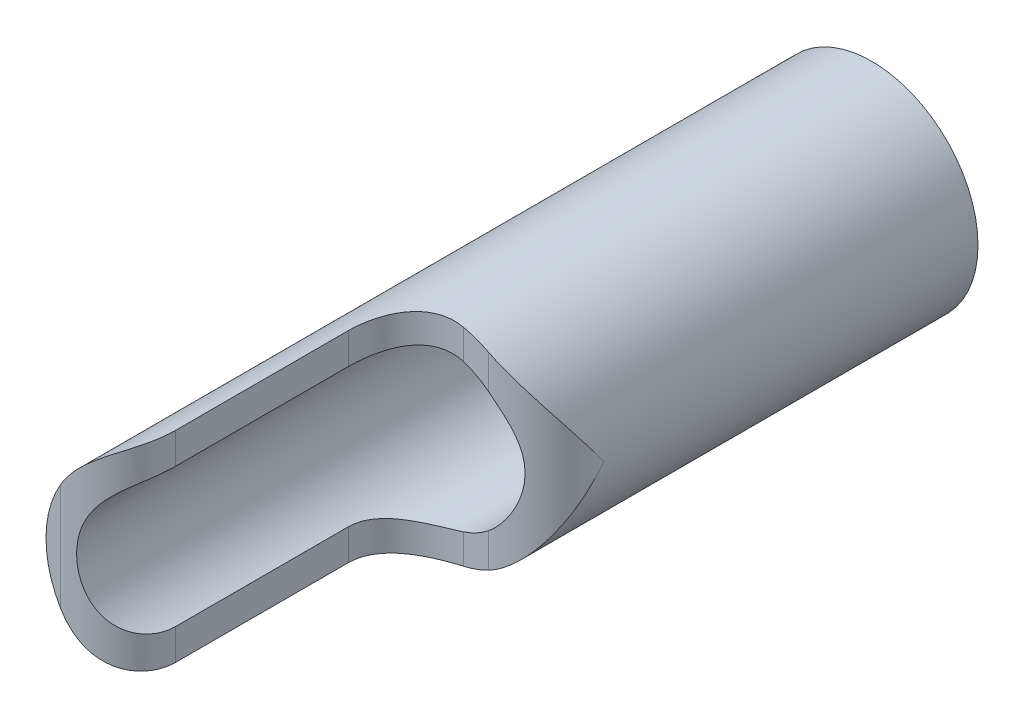
ISO-10303-21;
HEADER;
FILE_DESCRIPTION(('STEP AP214'),'2;1');
FILE_NAME('part.step','',(''),(''),'','','');
FILE_SCHEMA(('AUTOMOTIVE_DESIGN { 1 0 10303 214 1 1 1 1 }'));
ENDSEC;
DATA;
#1=APPLICATION_CONTEXT('core data for automotive mechanical design processes');
#2=APPLICATION_PROTOCOL_DEFINITION('international standard','automotive_design',2000,#1);
#3=PRODUCT_CONTEXT('',#1,'mechanical');
#4=PRODUCT('Part','Part','',(#3));
#5=PRODUCT_RELATED_PRODUCT_CATEGORY('part','',(#4));
#6=PRODUCT_DEFINITION_FORMATION('','',#4);
#7=PRODUCT_DEFINITION_CONTEXT('part definition',#1,'design');
#8=PRODUCT_DEFINITION('design','',#6,#7);
#9=PRODUCT_DEFINITION_SHAPE('','',#8);
#10=(LENGTH_UNIT() NAMED_UNIT(*) SI_UNIT(.MILLI.,.METRE.));
#11=(NAMED_UNIT(*) PLANE_ANGLE_UNIT() SI_UNIT($,.RADIAN.));
#12=(NAMED_UNIT(*) SI_UNIT($,.STERADIAN.) SOLID_ANGLE_UNIT());
#13=UNCERTAINTY_MEASURE_WITH_UNIT(LENGTH_MEASURE(1.E-05),#10,'distance_accuracy_value','');
#14=(GEOMETRIC_REPRESENTATION_CONTEXT(3) GLOBAL_UNCERTAINTY_ASSIGNED_CONTEXT((#13)) GLOBAL_UNIT_ASSIGNED_CONTEXT((#10,
#11,#12)) REPRESENTATION_CONTEXT('',''));
#15=CARTESIAN_POINT('',(0.,0.,0.));
#16=DIRECTION('',(0.,0.,1.));
#17=DIRECTION('',(1.,0.,0.));
#18=AXIS2_PLACEMENT_3D('',#15,#16,#17);
#19=CARTESIAN_POINT('',(0.,0.,5.));
#20=DIRECTION('',(0.,0.,-1.));
#21=DIRECTION('',(-1.,0.,0.));
#22=AXIS2_PLACEMENT_3D('',#19,#20,#21);
#23=CYLINDRICAL_SURFACE('',#22,0.7375);
#24=CARTESIAN_POINT('',(0.,0.,0.));
#25=DIRECTION('',(0.,0.,1.));
#26=DIRECTION('',(1.,0.,0.));
#27=AXIS2_PLACEMENT_3D('',#24,#25,#26);
#28=CIRCLE('',#27,0.7375);
#29=CARTESIAN_POINT('',(0.7375,0.,0.));
#30=VERTEX_POINT('',#29);
#31=EDGE_CURVE('E222',#30,#30,#28,.T.);
#32=ORIENTED_EDGE('',*,*,#31,.T.);
#33=EDGE_LOOP('',(#32));
#34=FACE_BOUND('',#33,.T.);
#35=CARTESIAN_POINT('',(-0.637500000000003,-0.370809924354778,5.));
#36=CARTESIAN_POINT('',(-0.628996561726813,-0.385426199470406,4.99999552634086));
#37=CARTESIAN_POINT('',(-0.619995175292166,-0.399744608109435,4.99972816782554));
#38=CARTESIAN_POINT('',(-0.601026107855252,-0.427740760986939,4.99844869487231));
#39=CARTESIAN_POINT('',(-0.591056112702408,-0.441416849065786,4.99743475677476));
#40=CARTESIAN_POINT('',(-0.55968114869128,-0.481465378055254,4.99292644532362));
#41=CARTESIAN_POINT('',(-0.536913206082381,-0.506682799659907,4.98796036317441));
#42=CARTESIAN_POINT('',(-0.496754830920334,-0.545582431144041,4.9748125953865));
#43=CARTESIAN_POINT('',(-0.479947517963044,-0.560387297253672,4.96814919606611));
#44=CARTESIAN_POINT('',(-0.446072983673307,-0.587702879434716,4.95172115484977));
#45=CARTESIAN_POINT('',(-0.429007046892141,-0.600222402425055,4.94196883209247));
#46=CARTESIAN_POINT('',(-0.395361104572798,-0.622905631118335,4.9190386950324));
#47=CARTESIAN_POINT('',(-0.378785668461834,-0.633051084120656,4.90583589306849));
#48=CARTESIAN_POINT('',(-0.347299976385541,-0.650858818291728,4.87613749991046));
#49=CARTESIAN_POINT('',(-0.33239068298219,-0.658519668870198,4.85964002050001));
#50=CARTESIAN_POINT('',(-0.306550660670169,-0.670909095325852,4.82557550062884));
#51=CARTESIAN_POINT('',(-0.295373162641385,-0.67585153879584,4.80827195810973));
#52=CARTESIAN_POINT('',(-0.275699736612727,-0.684111969318612,4.77184202102915));
#53=CARTESIAN_POINT('',(-0.267204617463129,-0.687429466547539,4.75271507889511));
#54=CARTESIAN_POINT('',(-0.252781214588114,-0.692875065510066,4.71177619395298));
#55=CARTESIAN_POINT('',(-0.247081159101871,-0.694900606732425,4.68987007429617));
#56=CARTESIAN_POINT('',(-0.239422498838726,-0.697557351347066,4.64530955723594));
#57=CARTESIAN_POINT('',(-0.237467532070182,-0.698187199044752,4.62265445396798));
#58=CARTESIAN_POINT('',(-0.2375,-0.698212002188447,4.6));
#59=B_SPLINE_CURVE_WITH_KNOTS('',3,(#35,#36,#37,#38,#39,#40,#41,#42,#43,#44,#45,#46,#47,#48,#49,
#50,#51,#52,#53,#54,#55,#56,#57,#58),.UNSPECIFIED.,.F.,.F.,(4,2,2,2,2,2,2,2,2,2,2,4),(0.,
0.0506989116596377,0.101522077419487,0.203769618881773,0.273606241995814,0.34316777961049,
0.413247742123073,0.48336798410105,0.546612545880288,0.609876160387938,0.677684358930867,
0.745558393551069),.UNSPECIFIED.);
#60=CARTESIAN_POINT('',(-0.637500000000003,-0.370809924354778,5.));
#61=VERTEX_POINT('',#60);
#62=CARTESIAN_POINT('',(-0.2375,-0.698212002188447,4.6));
#63=VERTEX_POINT('',#62);
#64=EDGE_CURVE('E226',#61,#63,#59,.T.);
#65=ORIENTED_EDGE('',*,*,#64,.F.);
#66=CARTESIAN_POINT('',(0.,0.,5.));
#67=DIRECTION('',(0.,0.,1.));
#68=DIRECTION('',(1.,0.,0.));
#69=AXIS2_PLACEMENT_3D('',#66,#67,#68);
#70=CIRCLE('',#69,0.7375);
#71=CARTESIAN_POINT('',(-0.637500000000003,0.370809924354778,5.));
#72=VERTEX_POINT('',#71);
#73=EDGE_CURVE('E115',#72,#61,#70,.T.);
#74=ORIENTED_EDGE('',*,*,#73,.F.);
#75=CARTESIAN_POINT('',(-0.2375,0.698212002188447,4.6));
#76=CARTESIAN_POINT('',(-0.237476445974745,0.698192758905024,4.62111840469348));
#77=CARTESIAN_POINT('',(-0.239171097770688,0.697642997108637,4.64223545232983));
#78=CARTESIAN_POINT('',(-0.245832216795051,0.695338261074743,4.68388051258064));
#79=CARTESIAN_POINT('',(-0.250798811900248,0.693583239732177,4.70440850214033));
#80=CARTESIAN_POINT('',(-0.263845282866923,0.688721520441658,4.74430599262739));
#81=CARTESIAN_POINT('',(-0.271928060096577,0.685613562472494,4.76367439442968));
#82=CARTESIAN_POINT('',(-0.290845960278924,0.677805082605978,4.8006525945477));
#83=CARTESIAN_POINT('',(-0.301679163276668,0.673105670873782,4.81826360772406));
#84=CARTESIAN_POINT('',(-0.325432494624503,0.661943399039492,4.85103454828523));
#85=CARTESIAN_POINT('',(-0.338324917044552,0.65550325782534,4.86622229996062));
#86=CARTESIAN_POINT('',(-0.365634552856454,0.640670367383024,4.8940568391825));
#87=CARTESIAN_POINT('',(-0.380051800180328,0.6322775746974,4.90670357016534));
#88=CARTESIAN_POINT('',(-0.409675855780943,0.613497376445984,4.92930802759275));
#89=CARTESIAN_POINT('',(-0.424883027292533,0.603109047231436,4.93926450367716));
#90=CARTESIAN_POINT('',(-0.455365243953354,0.580439845767292,4.95655952110908));
#91=CARTESIAN_POINT('',(-0.470640314866119,0.56815818256183,4.96389696406703));
#92=CARTESIAN_POINT('',(-0.505881459833931,0.537317740974416,4.97835815189728));
#93=CARTESIAN_POINT('',(-0.525630961103552,0.518061567766144,4.98451967993364));
#94=CARTESIAN_POINT('',(-0.563160941238663,0.477004865147337,4.99350766627409));
#95=CARTESIAN_POINT('',(-0.580937702613298,0.455199685854794,4.99632792176145));
#96=CARTESIAN_POINT('',(-0.604623945817655,0.422477828350383,4.99871203094801));
#97=CARTESIAN_POINT('',(-0.611574254600024,0.412352159127204,4.99921536099166));
#98=CARTESIAN_POINT('',(-0.624935418219899,0.391805060899791,4.99985816294509));
#99=CARTESIAN_POINT('',(-0.631348589098136,0.381385191641392,4.99999928407447));
#100=CARTESIAN_POINT('',(-0.637500000000003,0.370809924354778,5.));
#101=B_SPLINE_CURVE_WITH_KNOTS('',3,(#75,#76,#77,#78,#79,#80,#81,#82,#83,#84,#85,#86,#87,#88,
#89,#90,#91,#92,#93,#94,#95,#96,#97,#98,#99,#100),.UNSPECIFIED.,.F.,.F.,(4,2,2,2,2,2,2,2,2,2,2,
2,4),(0.,0.0632790392228509,0.126560551715866,0.189901126259248,0.253197606436818,
0.315704849377474,0.378213483588335,0.440751120399606,0.503314953978146,0.587642253815969,
0.672125856746996,0.708985475002355,0.745676962863285),.UNSPECIFIED.);
#102=CARTESIAN_POINT('',(-0.2375,0.698212002188447,4.6));
#103=VERTEX_POINT('',#102);
#104=EDGE_CURVE('E229',#103,#72,#101,.T.);
#105=ORIENTED_EDGE('',*,*,#104,.F.);
#106=DIRECTION('',(0.,0.,-1.));
#107=VECTOR('',#106,1.);
#108=CARTESIAN_POINT('',(-0.2375,0.698212002188447,5.));
#109=LINE('',#108,#107);
#110=CARTESIAN_POINT('',(-0.2375,0.698212002188447,3.4));
#111=VERTEX_POINT('',#110);
#112=EDGE_CURVE('E122',#111,#103,#109,.F.);
#113=ORIENTED_EDGE('',*,*,#112,.F.);
#114=CARTESIAN_POINT('',(0.162500000000003,0.719374728496908,3.));
#115=CARTESIAN_POINT('',(0.142694717190646,0.723878082893564,2.99997128296188));
#116=CARTESIAN_POINT('',(0.122693530012335,0.727507666622426,3.00146989147211));
#117=CARTESIAN_POINT('',(0.0829734689168517,0.733083365059043,3.00748037697718));
#118=CARTESIAN_POINT('',(0.0632539204231128,0.735034576254266,3.01198305743763));
#119=CARTESIAN_POINT('',(0.0246290168082387,0.737344992502883,3.02396491479157));
#120=CARTESIAN_POINT('',(0.00572426571177353,0.737703035950773,3.03144625915074));
#121=CARTESIAN_POINT('',(-0.030714129515712,0.737085257765069,3.0491740808542));
#122=CARTESIAN_POINT('',(-0.0482473809673,0.736109055585531,3.05942134640974));
#123=CARTESIAN_POINT('',(-0.0818177399852219,0.733145239757301,3.08261521311406));
#124=CARTESIAN_POINT('',(-0.0978204700499401,0.731138932619787,3.09560899690926));
#125=CARTESIAN_POINT('',(-0.127606711909665,0.726533042569313,3.12384822442694));
#126=CARTESIAN_POINT('',(-0.141388871430826,0.723933100458718,3.13909502943246));
#127=CARTESIAN_POINT('',(-0.16746129926039,0.718369820785761,3.17281005213091));
#128=CARTESIAN_POINT('',(-0.179541831661347,0.715394083044209,3.19143885782087));
#129=CARTESIAN_POINT('',(-0.200474264772106,0.709812136004042,3.23047080431263));
#130=CARTESIAN_POINT('',(-0.209327824241046,0.707205737276637,3.25087302682718));
#131=CARTESIAN_POINT('',(-0.223363477701856,0.7029017394401,3.29240864257973));
#132=CARTESIAN_POINT('',(-0.228634322091982,0.701182447524812,3.31350963552811));
#133=CARTESIAN_POINT('',(-0.235717324583807,0.698818442681402,3.35639806828374));
#134=CARTESIAN_POINT('',(-0.237520107259952,0.698176643198914,3.37818720743292));
#135=CARTESIAN_POINT('',(-0.2375,0.698212002188447,3.4));
#136=B_SPLINE_CURVE_WITH_KNOTS('',3,(#114,#115,#116,#117,#118,#119,#120,#121,#122,#123,#124,
#125,#126,#127,#128,#129,#130,#131,#132,#133,#134,#135),.UNSPECIFIED.,.F.,.F.,(4,2,2,2,2,2,2,2,
2,2,4),(0.,0.060853374938409,0.121521305645053,0.182233463123826,0.242962940192574,
0.304835625681598,0.366745848880014,0.433645295926396,0.500510306026364,0.565651865429939,
0.630969279922107),.UNSPECIFIED.);
#137=CARTESIAN_POINT('',(0.162500000000003,0.719374728496908,3.));
#138=VERTEX_POINT('',#137);
#139=EDGE_CURVE('E176',#138,#111,#136,.T.);
#140=ORIENTED_EDGE('',*,*,#139,.F.);
#141=CARTESIAN_POINT('',(0.,0.,3.));
#142=DIRECTION('',(0.,0.,1.));
#143=DIRECTION('',(1.,0.,0.));
#144=AXIS2_PLACEMENT_3D('',#141,#142,#143);
#145=CIRCLE('',#144,0.7375);
#146=CARTESIAN_POINT('',(0.337499999999997,0.655743852430202,3.));
#147=VERTEX_POINT('',#146);
#148=EDGE_CURVE('E186',#147,#138,#145,.T.);
#149=ORIENTED_EDGE('',*,*,#148,.F.);
#150=CARTESIAN_POINT('',(0.337499999999998,0.655743852430202,3.));
#151=CARTESIAN_POINT('',(0.362367076326452,0.642977540472614,2.99999272383672));
#152=CARTESIAN_POINT('',(0.386344528897247,0.628819503021606,2.99768847114949));
#153=CARTESIAN_POINT('',(0.4318997805156,0.59841380187594,2.98938276520022));
#154=CARTESIAN_POINT('',(0.453500170501194,0.582189688148315,2.9834204618511));
#155=CARTESIAN_POINT('',(0.500208105441171,0.543034480767911,2.96648838096887));
#156=CARTESIAN_POINT('',(0.524478514947686,0.519534248622704,2.95456156984866));
#157=CARTESIAN_POINT('',(0.568890740945396,0.470500454147149,2.92732345427889));
#158=CARTESIAN_POINT('',(0.58900994534086,0.444956755441205,2.91199451079332));
#159=CARTESIAN_POINT('',(0.63250275278507,0.381904328989016,2.8723198340796));
#160=CARTESIAN_POINT('',(0.653887475598739,0.34374416188204,2.84683842170703));
#161=CARTESIAN_POINT('',(0.689197556047606,0.265966918663157,2.79323247271032));
#162=CARTESIAN_POINT('',(0.703122819434776,0.226349824150168,2.76510790269595));
#163=CARTESIAN_POINT('',(0.721418667234227,0.156288857891478,2.71461674587146));
#164=CARTESIAN_POINT('',(0.727302340190862,0.126006587450632,2.69255191428825));
#165=CARTESIAN_POINT('',(0.735243028397519,0.0652682125696525,2.64806207783041));
#166=CARTESIAN_POINT('',(0.737306607340444,0.0348124966561384,2.62563775764427));
#167=CARTESIAN_POINT('',(0.737495674021141,0.00291554164716203,2.60214717803077));
#168=CARTESIAN_POINT('',(0.737499995675227,0.00145774468968771,2.60107356925657));
#169=CARTESIAN_POINT('',(0.7375,0.,2.6));
#170=B_SPLINE_CURVE_WITH_KNOTS('',3,(#150,#151,#152,#153,#154,#155,#156,#157,#158,#159,#160,
#161,#162,#163,#164,#165,#166,#167,#168,#169),.UNSPECIFIED.,.F.,.F.,(4,2,2,2,2,2,2,2,2,4),(0.,
0.0834898432603343,0.166101365561473,0.273011344254887,0.380489135239561,0.531551910981967,
0.682616595312141,0.796217947780126,0.909623928367917,0.915055334092762),.UNSPECIFIED.);
#171=CARTESIAN_POINT('',(0.7375,0.,2.6));
#172=VERTEX_POINT('',#171);
#173=EDGE_CURVE('E187',#172,#147,#170,.F.);
#174=ORIENTED_EDGE('',*,*,#173,.F.);
#175=CARTESIAN_POINT('',(0.337499999999998,-0.655743852430202,3.));
#176=CARTESIAN_POINT('',(0.362367076326452,-0.642977540472614,2.99999272383672));
#177=CARTESIAN_POINT('',(0.386344528897247,-0.628819503021606,2.99768847114949));
#178=CARTESIAN_POINT('',(0.4318997805156,-0.59841380187594,2.98938276520022));
#179=CARTESIAN_POINT('',(0.453500170501194,-0.582189688148315,2.9834204618511));
#180=CARTESIAN_POINT('',(0.500208105441171,-0.543034480767911,2.96648838096887));
#181=CARTESIAN_POINT('',(0.524478514947686,-0.519534248622704,2.95456156984866));
#182=CARTESIAN_POINT('',(0.568890740945396,-0.470500454147149,2.92732345427889));
#183=CARTESIAN_POINT('',(0.58900994534086,-0.444956755441205,2.91199451079332));
#184=CARTESIAN_POINT('',(0.63250275278507,-0.381904328989016,2.8723198340796));
#185=CARTESIAN_POINT('',(0.653887475598739,-0.34374416188204,2.84683842170703));
#186=CARTESIAN_POINT('',(0.689197556047606,-0.265966918663157,2.79323247271032));
#187=CARTESIAN_POINT('',(0.703122819434776,-0.226349824150168,2.76510790269595));
#188=CARTESIAN_POINT('',(0.721418667234227,-0.156288857891478,2.71461674587146));
#189=CARTESIAN_POINT('',(0.727302340190862,-0.126006587450632,2.69255191428825));
#190=CARTESIAN_POINT('',(0.735243028397519,-0.0652682125696525,2.64806207783041));
#191=CARTESIAN_POINT('',(0.737306607340444,-0.0348124966561384,2.62563775764427));
#192=CARTESIAN_POINT('',(0.737495674021141,-0.00291554164716203,2.60214717803077));
#193=CARTESIAN_POINT('',(0.737499995675227,-0.00145774468968771,2.60107356925657));
#194=CARTESIAN_POINT('',(0.7375,0.,2.6));
#195=B_SPLINE_CURVE_WITH_KNOTS('',3,(#175,#176,#177,#178,#179,#180,#181,#182,#183,#184,#185,
#186,#187,#188,#189,#190,#191,#192,#193,#194),.UNSPECIFIED.,.F.,.F.,(4,2,2,2,2,2,2,2,2,4),(0.,
0.0834898432603343,0.166101365561473,0.273011344254887,0.380489135239561,0.531551910981967,
0.682616595312141,0.796217947780126,0.909623928367917,0.915055334092762),.UNSPECIFIED.);
#196=CARTESIAN_POINT('',(0.337499999999997,-0.655743852430202,3.));
#197=VERTEX_POINT('',#196);
#198=EDGE_CURVE('E193',#197,#172,#195,.T.);
#199=ORIENTED_EDGE('',*,*,#198,.F.);
#200=CARTESIAN_POINT('',(0.162500000000003,-0.719374728496908,3.));
#201=VERTEX_POINT('',#200);
#202=EDGE_CURVE('E184',#201,#197,#145,.T.);
#203=ORIENTED_EDGE('',*,*,#202,.F.);
#204=CARTESIAN_POINT('',(-0.2375,-0.698212002188447,3.4));
#205=CARTESIAN_POINT('',(-0.237520924262842,-0.698175343363305,3.37798475648705));
#206=CARTESIAN_POINT('',(-0.235684114549617,-0.698829750909065,3.35599352910171));
#207=CARTESIAN_POINT('',(-0.228471601029537,-0.701236105496217,3.31273083734603));
#208=CARTESIAN_POINT('',(-0.223107393151829,-0.702984486341482,3.29145727007067));
#209=CARTESIAN_POINT('',(-0.209019448473507,-0.707296123192682,3.25016520826842));
#210=CARTESIAN_POINT('',(-0.200298015241077,-0.709858820243644,3.23014586408114));
#211=CARTESIAN_POINT('',(-0.179742635712777,-0.715340851565579,3.19180958759251));
#212=CARTESIAN_POINT('',(-0.167905908636984,-0.718260503209032,3.1734941961459));
#213=CARTESIAN_POINT('',(-0.140940143559106,-0.724042965916932,3.13840770363267));
#214=CARTESIAN_POINT('',(-0.125710865181665,-0.726900262829325,3.12171252763222));
#215=CARTESIAN_POINT('',(-0.0925936189319345,-0.73185542403546,3.09107350975676));
#216=CARTESIAN_POINT('',(-0.0747066716062983,-0.733953578782575,3.07712861653429));
#217=CARTESIAN_POINT('',(-0.0370222247880903,-0.73680872051416,3.05259682769332));
#218=CARTESIAN_POINT('',(-0.0172556586576067,-0.737584433214844,3.04196481957865));
#219=CARTESIAN_POINT('',(0.0237720856033643,-0.737401172912485,3.02416311025469));
#220=CARTESIAN_POINT('',(0.0450320487393986,-0.736443594718755,3.01699063098426));
#221=CARTESIAN_POINT('',(0.0824460121013702,-0.733048941460279,3.0077542180543));
#222=CARTESIAN_POINT('',(0.0984380865858376,-0.731078207885197,3.00483568060052));
#223=CARTESIAN_POINT('',(0.130493485122031,-0.726047503568434,3.00095347867413));
#224=CARTESIAN_POINT('',(0.146556829715901,-0.722987195501323,2.9999904202252));
#225=CARTESIAN_POINT('',(0.162500000000003,-0.719374728496908,3.));
#226=B_SPLINE_CURVE_WITH_KNOTS('',3,(#204,#205,#206,#207,#208,#209,#210,#211,#212,#213,#214,
#215,#216,#217,#218,#219,#220,#221,#222,#223,#224,#225),.UNSPECIFIED.,.F.,.F.,(4,2,2,2,2,2,2,2,
2,2,4),(0.,0.0659220925432566,0.13163040015283,0.197293701985209,0.263015816295341,
0.331025132205434,0.399008399666088,0.466020776240178,0.532979250762095,0.581957272055605,
0.630950469841611),.UNSPECIFIED.);
#227=CARTESIAN_POINT('',(-0.2375,-0.698212002188447,3.4));
#228=VERTEX_POINT('',#227);
#229=EDGE_CURVE('E170',#228,#201,#226,.T.);
#230=ORIENTED_EDGE('',*,*,#229,.F.);
#231=DIRECTION('',(0.,0.,-1.));
#232=VECTOR('',#231,1.);
#233=CARTESIAN_POINT('',(-0.2375,-0.698212002188447,5.));
#234=LINE('',#233,#232);
#235=EDGE_CURVE('E177',#63,#228,#234,.T.);
#236=ORIENTED_EDGE('',*,*,#235,.F.);
#237=EDGE_LOOP('',(#65,#74,#105,#113,#140,#149,#174,#199,#203,#230,#236));
#238=FACE_BOUND('',#237,.T.);
#239=ADVANCED_FACE('F32',(#34,#238),#23,.T.);
#240=CARTESIAN_POINT('',(0.,0.,5.));
#241=DIRECTION('',(0.,0.,-1.));
#242=DIRECTION('',(-1.,0.,0.));
#243=AXIS2_PLACEMENT_3D('',#240,#241,#242);
#244=CYLINDRICAL_SURFACE('',#243,0.5375);
#245=CARTESIAN_POINT('',(0.,0.,0.));
#246=DIRECTION('',(0.,0.,1.));
#247=DIRECTION('',(1.,0.,0.));
#248=AXIS2_PLACEMENT_3D('',#245,#246,#247);
#249=CIRCLE('',#248,0.5375);
#250=CARTESIAN_POINT('',(0.5375,0.,0.));
#251=VERTEX_POINT('',#250);
#252=EDGE_CURVE('E280',#251,#251,#249,.T.);
#253=ORIENTED_EDGE('',*,*,#252,.F.);
#254=EDGE_LOOP('',(#253));
#255=FACE_BOUND('',#254,.T.);
#256=CARTESIAN_POINT('',(0.,0.,3.));
#257=DIRECTION('',(0.,0.,1.));
#258=DIRECTION('',(1.,0.,0.));
#259=AXIS2_PLACEMENT_3D('',#256,#257,#258);
#260=CIRCLE('',#259,0.5375);
#261=CARTESIAN_POINT('',(0.162500000000003,-0.512347538297979,3.));
#262=VERTEX_POINT('',#261);
#263=CARTESIAN_POINT('',(0.337499999999997,-0.41833001326704,3.));
#264=VERTEX_POINT('',#263);
#265=EDGE_CURVE('E352',#262,#264,#260,.T.);
#266=ORIENTED_EDGE('',*,*,#265,.T.);
#267=CARTESIAN_POINT('',(0.337499999999998,-0.41833001326704,3.));
#268=CARTESIAN_POINT('',(0.359273978932191,-0.400781463859006,2.99998818593622));
#269=CARTESIAN_POINT('',(0.379552027197627,-0.381601791338084,2.99822749254655));
#270=CARTESIAN_POINT('',(0.416714090932502,-0.340606851884415,2.99252817329268));
#271=CARTESIAN_POINT('',(0.433612483293453,-0.318803409718792,2.98859905240678));
#272=CARTESIAN_POINT('',(0.463739241651148,-0.273129756092368,2.97987977859214));
#273=CARTESIAN_POINT('',(0.476983961296415,-0.249269402953364,2.97509362594326));
#274=CARTESIAN_POINT('',(0.499755860025098,-0.199734295318798,2.96582005345011));
#275=CARTESIAN_POINT('',(0.509277777395294,-0.174057032909144,2.96133306380638));
#276=CARTESIAN_POINT('',(0.525237927817365,-0.118197091304364,2.95333461240189));
#277=CARTESIAN_POINT('',(0.531176462723935,-0.0878412563834462,2.95000197667996));
#278=CARTESIAN_POINT('',(0.537734427508156,-0.0264151284636312,2.94629839093263));
#279=CARTESIAN_POINT('',(0.538364075146914,0.00465367663922553,2.94592175173898));
#280=CARTESIAN_POINT('',(0.534546515497908,0.0624437808457871,2.94810125294943));
#281=CARTESIAN_POINT('',(0.530722906585841,0.0892238798200117,2.95029735614784));
#282=CARTESIAN_POINT('',(0.519169190095633,0.141755750457248,2.95642459311644));
#283=CARTESIAN_POINT('',(0.51143182532009,0.167505515525867,2.96035894837049));
#284=CARTESIAN_POINT('',(0.491888643924289,0.218466374192933,2.96916542426225));
#285=CARTESIAN_POINT('',(0.479929971633536,0.243612823300619,2.97406921027158));
#286=CARTESIAN_POINT('',(0.452262664278041,0.29177665788276,2.98346095406692));
#287=CARTESIAN_POINT('',(0.436562517099425,0.314798701108954,2.98794982159845));
#288=CARTESIAN_POINT('',(0.407093462857348,0.351494146025094,2.99409006740046));
#289=CARTESIAN_POINT('',(0.39425455823349,0.36584056153043,2.99618979629448));
#290=CARTESIAN_POINT('',(0.367012927454278,0.393169863645469,2.999145303603));
#291=CARTESIAN_POINT('',(0.352606383911212,0.406149263177364,2.99999796899082));
#292=CARTESIAN_POINT('',(0.337499999999997,0.41833001326704,3.));
#293=B_SPLINE_CURVE_WITH_KNOTS('',3,(#267,#268,#269,#270,#271,#272,#273,#274,#275,#276,#277,
#278,#279,#280,#281,#282,#283,#284,#285,#286,#287,#288,#289,#290,#291,#292),.UNSPECIFIED.,.F.,
.F.,(4,2,2,2,2,2,2,2,2,2,2,2,4),(0.,0.0835619277588196,0.166760450462991,0.249580304716672,
0.332516794887423,0.425290147006809,0.517884901841691,0.598927338254845,0.680120603923694,
0.764620479195682,0.848930453472342,0.906890378789058,0.964994743133208),.UNSPECIFIED.);
#294=CARTESIAN_POINT('',(0.337499999999997,0.41833001326704,3.));
#295=VERTEX_POINT('',#294);
#296=EDGE_CURVE('E11',#264,#295,#293,.T.);
#297=ORIENTED_EDGE('',*,*,#296,.T.);
#298=CARTESIAN_POINT('',(0.162500000000003,0.512347538297979,3.));
#299=VERTEX_POINT('',#298);
#300=EDGE_CURVE('E46',#295,#299,#260,.T.);
#301=ORIENTED_EDGE('',*,*,#300,.T.);
#302=CARTESIAN_POINT('',(0.162500000000003,0.512347538297979,3.));
#303=CARTESIAN_POINT('',(0.144568558814499,0.51806756802947,2.99996926510194));
#304=CARTESIAN_POINT('',(0.126317021643056,0.52278801723525,3.00120478102256));
#305=CARTESIAN_POINT('',(0.0898338005099877,0.530257040165967,3.00623486891216));
#306=CARTESIAN_POINT('',(0.07160228675133,0.53301273998798,3.01002009494789));
#307=CARTESIAN_POINT('',(0.0356605548427395,0.536622566480448,3.02018088334493));
#308=CARTESIAN_POINT('',(0.0179509156265123,0.537474654379374,3.02655921429579));
#309=CARTESIAN_POINT('',(-0.0163932494217824,0.537524217053534,3.04174067179047));
#310=CARTESIAN_POINT('',(-0.0330274446190128,0.53672118544974,3.0505445397064));
#311=CARTESIAN_POINT('',(-0.0650728277804065,0.533793373550097,3.07049576640217));
#312=CARTESIAN_POINT('',(-0.0804592164002238,0.531646936493477,3.08167950136238));
#313=CARTESIAN_POINT('',(-0.109410498226309,0.526452535184965,3.10602222363929));
#314=CARTESIAN_POINT('',(-0.122974230066009,0.523404000054863,3.1191824591475));
#315=CARTESIAN_POINT('',(-0.149716103528864,0.516436309936419,3.14905412992172));
#316=CARTESIAN_POINT('',(-0.162611286111321,0.512455425529546,3.16600492106767));
#317=CARTESIAN_POINT('',(-0.185573490564858,0.504595391723477,3.20176567566827));
#318=CARTESIAN_POINT('',(-0.195637940729963,0.500716337718291,3.2205773088546));
#319=CARTESIAN_POINT('',(-0.213326853522544,0.493453312008776,3.2611489197754));
#320=CARTESIAN_POINT('',(-0.220713834296899,0.490127710775754,3.2830241340701));
#321=CARTESIAN_POINT('',(-0.231611121581875,0.485078482135044,3.32785703488205));
#322=CARTESIAN_POINT('',(-0.235133007107078,0.483350072348272,3.35081127220444));
#323=CARTESIAN_POINT('',(-0.237217553748553,0.482319742806852,3.382588915572));
#324=CARTESIAN_POINT('',(-0.23750326147758,0.482176776612737,3.39129654110246));
#325=CARTESIAN_POINT('',(-0.237500000000001,0.482182538049816,3.40000000000001));
#326=B_SPLINE_CURVE_WITH_KNOTS('',3,(#302,#303,#304,#305,#306,#307,#308,#309,#310,#311,#312,
#313,#314,#315,#316,#317,#318,#319,#320,#321,#322,#323,#324,#325),.UNSPECIFIED.,.F.,.F.,(4,2,2,
2,2,2,2,2,2,2,2,4),(0.,0.0563973229589648,0.112589039049587,0.168840907768985,0.225109989139691,
0.282310400804569,0.339547088523822,0.404277124553033,0.469065778925896,0.538678598716729,
0.60808229895708,0.634199184760811),.UNSPECIFIED.);
#327=CARTESIAN_POINT('',(-0.2375,0.482182538049648,3.4));
#328=VERTEX_POINT('',#327);
#329=EDGE_CURVE('E130',#299,#328,#326,.T.);
#330=ORIENTED_EDGE('',*,*,#329,.T.);
#331=DIRECTION('',(0.,0.,-1.));
#332=VECTOR('',#331,1.);
#333=CARTESIAN_POINT('',(-0.2375,0.482182538049648,5.));
#334=LINE('',#333,#332);
#335=CARTESIAN_POINT('',(-0.2375,0.482182538049648,4.6));
#336=VERTEX_POINT('',#335);
#337=EDGE_CURVE('E114',#328,#336,#334,.F.);
#338=ORIENTED_EDGE('',*,*,#337,.T.);
#339=CARTESIAN_POINT('',(-0.2375,0.482182538049648,4.6));
#340=CARTESIAN_POINT('',(-0.237474502565265,0.482160518416086,4.61981845541681));
#341=CARTESIAN_POINT('',(-0.238971503838128,0.48145688967973,4.63963888938524));
#342=CARTESIAN_POINT('',(-0.244836924685399,0.478519369738206,4.67874982931369));
#343=CARTESIAN_POINT('',(-0.249207630180777,0.476284260239425,4.69803990065361));
#344=CARTESIAN_POINT('',(-0.260653824766357,0.470112215805685,4.73554736479044));
#345=CARTESIAN_POINT('',(-0.267732835658847,0.466173064107863,4.75376332509755));
#346=CARTESIAN_POINT('',(-0.284192869233313,0.456325183101595,4.78852831305541));
#347=CARTESIAN_POINT('',(-0.293571400533957,0.450418582929467,4.80507911760524));
#348=CARTESIAN_POINT('',(-0.313811808799026,0.436548582944943,4.83570198958134));
#349=CARTESIAN_POINT('',(-0.324635901108775,0.42863403854028,4.84982114090624));
#350=CARTESIAN_POINT('',(-0.347192388733855,0.410574965612116,4.87571086621463));
#351=CARTESIAN_POINT('',(-0.35892483051216,0.400430322968,4.8874813199496));
#352=CARTESIAN_POINT('',(-0.382322515849352,0.378143654204515,4.90842818786207));
#353=CARTESIAN_POINT('',(-0.393986194909382,0.36603332237463,4.91764032854072));
#354=CARTESIAN_POINT('',(-0.416720971372668,0.339926230956028,4.93384425796916));
#355=CARTESIAN_POINT('',(-0.427791848433349,0.325928776637719,4.94083522581465));
#356=CARTESIAN_POINT('',(-0.44973444325246,0.295018267933522,4.95343843481415));
#357=CARTESIAN_POINT('',(-0.460498751524018,0.277956223182779,4.9588701911051));
#358=CARTESIAN_POINT('',(-0.480190226531103,0.242360265045422,4.96792836515531));
#359=CARTESIAN_POINT('',(-0.489116233806885,0.223825432886867,4.97155364556118));
#360=CARTESIAN_POINT('',(-0.506254109575426,0.182224528851193,4.97798606372427));
#361=CARTESIAN_POINT('',(-0.51404649456547,0.158944311468002,4.98052753851752));
#362=CARTESIAN_POINT('',(-0.526394690451035,0.111439012797698,4.98431372745813));
#363=CARTESIAN_POINT('',(-0.530948619274334,0.087213390688122,4.9855576877332));
#364=CARTESIAN_POINT('',(-0.53710600884197,0.0348377194170899,4.98721269096503));
#365=CARTESIAN_POINT('',(-0.538195229121005,0.00662130275283062,4.98747941253694));
#366=CARTESIAN_POINT('',(-0.535943648555131,-0.0496407450115895,4.98689440584334));
#367=CARTESIAN_POINT('',(-0.532599504448871,-0.077686231182111,4.98604183350754));
#368=CARTESIAN_POINT('',(-0.521378701129078,-0.133869959420029,4.982820601312));
#369=CARTESIAN_POINT('',(-0.513337523672442,-0.161972591393322,4.9803965409021));
#370=CARTESIAN_POINT('',(-0.492938166281744,-0.216226095066274,4.97312004589544));
#371=CARTESIAN_POINT('',(-0.480586038746226,-0.242379641056159,4.96827101175262));
#372=CARTESIAN_POINT('',(-0.455889131528271,-0.285529842347719,4.95658556841334));
#373=CARTESIAN_POINT('',(-0.444311934052941,-0.303182765509372,4.95054721538985));
#374=CARTESIAN_POINT('',(-0.419784744708696,-0.336318550340993,4.93586262111748));
#375=CARTESIAN_POINT('',(-0.406836222575996,-0.351803694831354,4.92721915395185));
#376=CARTESIAN_POINT('',(-0.380354113873838,-0.380286733700325,4.90684845394152));
#377=CARTESIAN_POINT('',(-0.366817078923394,-0.39326654278544,4.89510015058002));
#378=CARTESIAN_POINT('',(-0.340387614239969,-0.416354678061274,4.86846749454507));
#379=CARTESIAN_POINT('',(-0.327494917951968,-0.426464199893789,4.85358445218647));
#380=CARTESIAN_POINT('',(-0.304886521266079,-0.442858157484188,4.82290971073371));
#381=CARTESIAN_POINT('',(-0.29497575817564,-0.449450391846099,4.80742404297142));
#382=CARTESIAN_POINT('',(-0.27716840065447,-0.460646340553219,4.77466713257222));
#383=CARTESIAN_POINT('',(-0.269272827606124,-0.46524904733927,4.75739499068301));
#384=CARTESIAN_POINT('',(-0.256024362217294,-0.472667723718663,4.72179263863569));
#385=CARTESIAN_POINT('',(-0.250642274714138,-0.475504343122237,4.703477499946));
#386=CARTESIAN_POINT('',(-0.242543628513689,-0.479688131149903,4.66613005196928));
#387=CARTESIAN_POINT('',(-0.239822724914932,-0.481037728085602,4.64709896455397));
#388=CARTESIAN_POINT('',(-0.23782487235872,-0.482021049360516,4.61865585349384));
#389=CARTESIAN_POINT('',(-0.237496734292427,-0.482180097053766,4.60932523889731));
#390=CARTESIAN_POINT('',(-0.237499999999998,-0.482182538049965,4.60000000000001));
#391=B_SPLINE_CURVE_WITH_KNOTS('',3,(#339,#340,#341,#342,#343,#344,#345,#346,#347,#348,#349,
#350,#351,#352,#353,#354,#355,#356,#357,#358,#359,#360,#361,#362,#363,#364,#365,#366,#367,#368,
#369,#370,#371,#372,#373,#374,#375,#376,#377,#378,#379,#380,#381,#382,#383,#384,#385,#386,#387,
#388,#389,#390),.UNSPECIFIED.,.F.,.F.,(4,2,2,2,2,2,2,2,2,2,2,2,2,2,2,2,2,2,2,2,2,2,2,2,2,4),(0.,
0.0593906589428064,0.118828618115732,0.178344132860075,0.237795449140072,0.295919682004909,
0.354046889948493,0.41131606888875,0.468606388901435,0.531047896843118,0.593528668310498,
0.667283566352241,0.741081293089627,0.825418214219325,0.909818771178539,0.997369599221955,
1.08479800067493,1.15040602338019,1.21594442805415,1.28193955971272,1.34790716008614,
1.4062170612872,1.46455645795146,1.52220024428177,1.57974975799976,1.60773230725826),.UNSPECIFIED.);
#392=CARTESIAN_POINT('',(-0.2375,-0.482182538049648,4.6));
#393=VERTEX_POINT('',#392);
#394=EDGE_CURVE('E109',#336,#393,#391,.T.);
#395=ORIENTED_EDGE('',*,*,#394,.T.);
#396=DIRECTION('',(0.,0.,-1.));
#397=VECTOR('',#396,1.);
#398=CARTESIAN_POINT('',(-0.2375,-0.482182538049648,5.));
#399=LINE('',#398,#397);
#400=CARTESIAN_POINT('',(-0.2375,-0.482182538049648,3.4));
#401=VERTEX_POINT('',#400);
#402=EDGE_CURVE('E131',#393,#401,#399,.T.);
#403=ORIENTED_EDGE('',*,*,#402,.T.);
#404=CARTESIAN_POINT('',(-0.2375,-0.482182538049648,3.4));
#405=CARTESIAN_POINT('',(-0.237522184592161,-0.482130696947714,3.37842514938005));
#406=CARTESIAN_POINT('',(-0.235756487214807,-0.483042241283851,3.3568930417494));
#407=CARTESIAN_POINT('',(-0.228856232064285,-0.486369906724637,3.31460862515029));
#408=CARTESIAN_POINT('',(-0.223739920633072,-0.488777875189477,3.29385273265943));
#409=CARTESIAN_POINT('',(-0.21035379663748,-0.49467911816104,3.25360673121387));
#410=CARTESIAN_POINT('',(-0.202089821857564,-0.498170381336727,3.23411435673288));
#411=CARTESIAN_POINT('',(-0.182635420061864,-0.505628149530661,3.19671077728902));
#412=CARTESIAN_POINT('',(-0.171439752943323,-0.509595498554975,3.17880248116702));
#413=CARTESIAN_POINT('',(-0.145498296878982,-0.517622104304384,3.14379037700464));
#414=CARTESIAN_POINT('',(-0.130563367815128,-0.521669375603888,3.12682328622441));
#415=CARTESIAN_POINT('',(-0.0979281042410683,-0.52876703461606,3.09555469930496));
#416=CARTESIAN_POINT('',(-0.0802300163065816,-0.531818226012452,3.08125105819385));
#417=CARTESIAN_POINT('',(-0.0429127115969403,-0.53610549296344,3.05605114602103));
#418=CARTESIAN_POINT('',(-0.0233443873533338,-0.537380062771857,3.04508677218521));
#419=CARTESIAN_POINT('',(0.0173671889060338,-0.537603321449656,3.02659043042335));
#420=CARTESIAN_POINT('',(0.0385086329352676,-0.536554641716372,3.01905459086819));
#421=CARTESIAN_POINT('',(0.076951074149024,-0.53223666714377,3.00886091223379));
#422=CARTESIAN_POINT('',(0.0941308943734967,-0.529477474938969,3.00551262277108));
#423=CARTESIAN_POINT('',(0.128466038318306,-0.522223833580364,3.00106842278975));
#424=CARTESIAN_POINT('',(0.145621164576521,-0.517724630816502,2.99997873496128));
#425=CARTESIAN_POINT('',(0.162500000000003,-0.512347538297979,3.));
#426=B_SPLINE_CURVE_WITH_KNOTS('',3,(#404,#405,#406,#407,#408,#409,#410,#411,#412,#413,#414,
#415,#416,#417,#418,#419,#420,#421,#422,#423,#424,#425),.UNSPECIFIED.,.F.,.F.,(4,2,2,2,2,2,2,2,
2,2,4),(0.,0.0645660666593409,0.128783419231713,0.192882247088426,0.25709643654915,
0.325661395586125,0.394170895695698,0.461171618270968,0.528096492181409,0.581029368474313,
0.634107887721411),.UNSPECIFIED.);
#427=EDGE_CURVE('E133',#401,#262,#426,.T.);
#428=ORIENTED_EDGE('',*,*,#427,.T.);
#429=EDGE_LOOP('',(#266,#297,#301,#330,#338,#395,#403,#428));
#430=FACE_BOUND('',#429,.T.);
#431=ADVANCED_FACE('F128',(#255,#430),#244,.F.);
#432=CARTESIAN_POINT('',(0.,0.,5.));
#433=DIRECTION('',(0.,0.,1.));
#434=DIRECTION('',(1.,0.,0.));
#435=AXIS2_PLACEMENT_3D('',#432,#433,#434);
#436=PLANE('',#435);
#437=DIRECTION('',(0.,-1.,0.));
#438=VECTOR('',#437,1.);
#439=CARTESIAN_POINT('',(-0.637500000000003,2.,5.));
#440=LINE('',#439,#438);
#441=EDGE_CURVE('E276',#72,#61,#440,.T.);
#442=ORIENTED_EDGE('',*,*,#441,.F.);
#443=ORIENTED_EDGE('',*,*,#73,.T.);
#444=EDGE_LOOP('',(#442,#443));
#445=FACE_BOUND('',#444,.T.);
#446=ADVANCED_FACE('F211',(#445),#436,.T.);
#447=CARTESIAN_POINT('',(0.,0.,0.));
#448=DIRECTION('',(0.,0.,1.));
#449=DIRECTION('',(1.,0.,0.));
#450=AXIS2_PLACEMENT_3D('',#447,#448,#449);
#451=PLANE('',#450);
#452=ORIENTED_EDGE('',*,*,#31,.F.);
#453=EDGE_LOOP('',(#452));
#454=FACE_BOUND('',#453,.T.);
#455=ORIENTED_EDGE('',*,*,#252,.T.);
#456=EDGE_LOOP('',(#455));
#457=FACE_BOUND('',#456,.T.);
#458=ADVANCED_FACE('F202',(#454,#457),#451,.F.);
#459=CARTESIAN_POINT('',(0.3375,2.,2.6));
#460=DIRECTION('',(0.,-1.,0.));
#461=DIRECTION('',(0.,0.,-1.));
#462=AXIS2_PLACEMENT_3D('',#459,#460,#461);
#463=CYLINDRICAL_SURFACE('',#462,0.4);
#464=ORIENTED_EDGE('',*,*,#198,.T.);
#465=ORIENTED_EDGE('',*,*,#173,.T.);
#466=DIRECTION('',(0.,-1.,0.));
#467=VECTOR('',#466,1.);
#468=CARTESIAN_POINT('',(0.337499999999997,2.,3.));
#469=LINE('',#468,#467);
#470=EDGE_CURVE('E231',#147,#295,#469,.T.);
#471=ORIENTED_EDGE('',*,*,#470,.T.);
#472=ORIENTED_EDGE('',*,*,#296,.F.);
#473=EDGE_CURVE('E269',#264,#197,#469,.T.);
#474=ORIENTED_EDGE('',*,*,#473,.T.);
#475=EDGE_LOOP('',(#464,#465,#471,#472,#474));
#476=FACE_BOUND('',#475,.T.);
#477=ADVANCED_FACE('F199',(#476),#463,.T.);
#478=CARTESIAN_POINT('',(0.162500000000003,2.,3.));
#479=DIRECTION('',(0.,0.,1.));
#480=DIRECTION('',(1.,0.,0.));
#481=AXIS2_PLACEMENT_3D('',#478,#479,#480);
#482=PLANE('',#481);
#483=ORIENTED_EDGE('',*,*,#148,.T.);
#484=DIRECTION('',(0.,-1.,0.));
#485=VECTOR('',#484,1.);
#486=CARTESIAN_POINT('',(0.162500000000003,2.,3.));
#487=LINE('',#486,#485);
#488=EDGE_CURVE('E272',#138,#299,#487,.T.);
#489=ORIENTED_EDGE('',*,*,#488,.T.);
#490=ORIENTED_EDGE('',*,*,#300,.F.);
#491=ORIENTED_EDGE('',*,*,#470,.F.);
#492=EDGE_LOOP('',(#483,#489,#490,#491));
#493=FACE_BOUND('',#492,.T.);
#494=ADVANCED_FACE('F164',(#493),#482,.T.);
#495=ORIENTED_EDGE('',*,*,#202,.T.);
#496=ORIENTED_EDGE('',*,*,#473,.F.);
#497=ORIENTED_EDGE('',*,*,#265,.F.);
#498=EDGE_CURVE('E270',#262,#201,#487,.T.);
#499=ORIENTED_EDGE('',*,*,#498,.T.);
#500=EDGE_LOOP('',(#495,#496,#497,#499));
#501=FACE_BOUND('',#500,.T.);
#502=ADVANCED_FACE('F161',(#501),#482,.T.);
#503=CARTESIAN_POINT('',(0.1625,2.,3.4));
#504=DIRECTION('',(0.,-1.,0.));
#505=DIRECTION('',(0.,0.,-1.));
#506=AXIS2_PLACEMENT_3D('',#503,#504,#505);
#507=CYLINDRICAL_SURFACE('',#506,0.4);
#508=ORIENTED_EDGE('',*,*,#139,.T.);
#509=DIRECTION('',(0.,-1.,0.));
#510=VECTOR('',#509,1.);
#511=CARTESIAN_POINT('',(-0.2375,2.,3.4));
#512=LINE('',#511,#510);
#513=EDGE_CURVE('E261',#111,#328,#512,.T.);
#514=ORIENTED_EDGE('',*,*,#513,.T.);
#515=ORIENTED_EDGE('',*,*,#329,.F.);
#516=ORIENTED_EDGE('',*,*,#488,.F.);
#517=EDGE_LOOP('',(#508,#514,#515,#516));
#518=FACE_BOUND('',#517,.T.);
#519=ADVANCED_FACE('F155',(#518),#507,.F.);
#520=ORIENTED_EDGE('',*,*,#229,.T.);
#521=ORIENTED_EDGE('',*,*,#498,.F.);
#522=ORIENTED_EDGE('',*,*,#427,.F.);
#523=EDGE_CURVE('E124',#401,#228,#512,.T.);
#524=ORIENTED_EDGE('',*,*,#523,.T.);
#525=EDGE_LOOP('',(#520,#521,#522,#524));
#526=FACE_BOUND('',#525,.T.);
#527=ADVANCED_FACE('F160',(#526),#507,.F.);
#528=CARTESIAN_POINT('',(-0.2375,2.,4.6));
#529=DIRECTION('',(1.,0.,0.));
#530=DIRECTION('',(0.,0.,-1.));
#531=AXIS2_PLACEMENT_3D('',#528,#529,#530);
#532=PLANE('',#531);
#533=ORIENTED_EDGE('',*,*,#235,.T.);
#534=ORIENTED_EDGE('',*,*,#523,.F.);
#535=ORIENTED_EDGE('',*,*,#402,.F.);
#536=DIRECTION('',(0.,-1.,0.));
#537=VECTOR('',#536,1.);
#538=CARTESIAN_POINT('',(-0.2375,2.,4.6));
#539=LINE('',#538,#537);
#540=EDGE_CURVE('E59',#393,#63,#539,.T.);
#541=ORIENTED_EDGE('',*,*,#540,.T.);
#542=EDGE_LOOP('',(#533,#534,#535,#541));
#543=FACE_BOUND('',#542,.T.);
#544=ADVANCED_FACE('F163',(#543),#532,.T.);
#545=ORIENTED_EDGE('',*,*,#112,.T.);
#546=EDGE_CURVE('E53',#103,#336,#539,.T.);
#547=ORIENTED_EDGE('',*,*,#546,.T.);
#548=ORIENTED_EDGE('',*,*,#337,.F.);
#549=ORIENTED_EDGE('',*,*,#513,.F.);
#550=EDGE_LOOP('',(#545,#547,#548,#549));
#551=FACE_BOUND('',#550,.T.);
#552=ADVANCED_FACE('F118',(#551),#532,.T.);
#553=CARTESIAN_POINT('',(-0.6375,2.,4.6));
#554=DIRECTION('',(0.,-1.,0.));
#555=DIRECTION('',(0.,0.,-1.));
#556=AXIS2_PLACEMENT_3D('',#553,#554,#555);
#557=CYLINDRICAL_SURFACE('',#556,0.4);
#558=ORIENTED_EDGE('',*,*,#64,.T.);
#559=ORIENTED_EDGE('',*,*,#540,.F.);
#560=ORIENTED_EDGE('',*,*,#394,.F.);
#561=ORIENTED_EDGE('',*,*,#546,.F.);
#562=ORIENTED_EDGE('',*,*,#104,.T.);
#563=ORIENTED_EDGE('',*,*,#441,.T.);
#564=EDGE_LOOP('',(#558,#559,#560,#561,#562,#563));
#565=FACE_BOUND('',#564,.T.);
#566=ADVANCED_FACE('F110',(#565),#557,.T.);
#567=CLOSED_SHELL('',(#239,#431,#446,#458,#477,#494,#502,#519,#527,#544,#552,#566));
#568=MANIFOLD_SOLID_BREP('B2',#567);
#569=ADVANCED_BREP_SHAPE_REPRESENTATION('',(#18,#568),#14);
#570=SHAPE_DEFINITION_REPRESENTATION(#9,#569);
ENDSEC;
END-ISO-10303-21;
